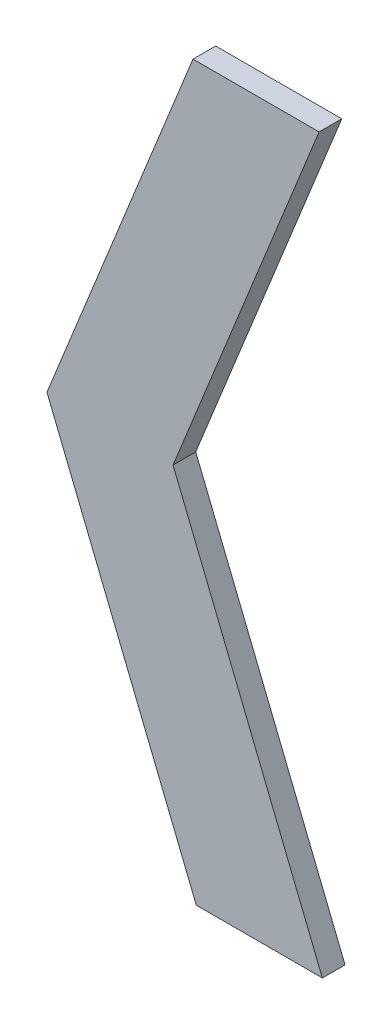
ISO-10303-21;
HEADER;
FILE_DESCRIPTION(('STEP AP214'),'2;1');
FILE_NAME('part.step','',(''),(''),'','','');
FILE_SCHEMA(('AUTOMOTIVE_DESIGN { 1 0 10303 214 1 1 1 1 }'));
ENDSEC;
DATA;
#1=APPLICATION_CONTEXT('core data for automotive mechanical design processes');
#2=APPLICATION_PROTOCOL_DEFINITION('international standard','automotive_design',2000,#1);
#3=PRODUCT_CONTEXT('',#1,'mechanical');
#4=PRODUCT('Part','Part','',(#3));
#5=PRODUCT_RELATED_PRODUCT_CATEGORY('part','',(#4));
#6=PRODUCT_DEFINITION_FORMATION('','',#4);
#7=PRODUCT_DEFINITION_CONTEXT('part definition',#1,'design');
#8=PRODUCT_DEFINITION('design','',#6,#7);
#9=PRODUCT_DEFINITION_SHAPE('','',#8);
#10=(LENGTH_UNIT() NAMED_UNIT(*) SI_UNIT(.MILLI.,.METRE.));
#11=(NAMED_UNIT(*) PLANE_ANGLE_UNIT() SI_UNIT($,.RADIAN.));
#12=(NAMED_UNIT(*) SI_UNIT($,.STERADIAN.) SOLID_ANGLE_UNIT());
#13=UNCERTAINTY_MEASURE_WITH_UNIT(LENGTH_MEASURE(1.E-05),#10,'distance_accuracy_value','');
#14=(GEOMETRIC_REPRESENTATION_CONTEXT(3) GLOBAL_UNCERTAINTY_ASSIGNED_CONTEXT((#13)) GLOBAL_UNIT_ASSIGNED_CONTEXT((#10,
#11,#12)) REPRESENTATION_CONTEXT('',''));
#15=CARTESIAN_POINT('',(0.,0.,0.));
#16=DIRECTION('',(0.,0.,1.));
#17=DIRECTION('',(1.,0.,0.));
#18=AXIS2_PLACEMENT_3D('',#15,#16,#17);
#19=CARTESIAN_POINT('',(0.236672679429646,-0.56437912510646,0.));
#20=DIRECTION('',(0.927183854566676,0.374606593416189,0.));
#21=DIRECTION('',(-0.374606593416189,0.927183854566676,0.));
#22=AXIS2_PLACEMENT_3D('',#19,#20,#21);
#23=PLANE('',#22);
#24=DIRECTION('',(-0.374606593416189,0.927183854566676,0.));
#25=VECTOR('',#24,1.);
#26=CARTESIAN_POINT('',(0.236672679429646,-0.56437912510646,0.));
#27=LINE('',#26,#25);
#28=CARTESIAN_POINT('',(0.236672679429646,-0.56437912510646,0.));
#29=VERTEX_POINT('',#28);
#30=CARTESIAN_POINT('',(0.216922463419016,-0.515495625106459,0.));
#31=VERTEX_POINT('',#30);
#32=EDGE_CURVE('E11',#29,#31,#27,.T.);
#33=ORIENTED_EDGE('',*,*,#32,.T.);
#34=DIRECTION('',(0.,0.,1.));
#35=VECTOR('',#34,1.);
#36=CARTESIAN_POINT('',(0.216922463419016,-0.515495625106459,0.));
#37=LINE('',#36,#35);
#38=CARTESIAN_POINT('',(0.216922463419016,-0.515495625106459,0.003));
#39=VERTEX_POINT('',#38);
#40=EDGE_CURVE('E24',#31,#39,#37,.T.);
#41=ORIENTED_EDGE('',*,*,#40,.T.);
#42=DIRECTION('',(-0.374606593416189,0.927183854566676,0.));
#43=VECTOR('',#42,1.);
#44=CARTESIAN_POINT('',(0.236672679429646,-0.56437912510646,0.003));
#45=LINE('',#44,#43);
#46=CARTESIAN_POINT('',(0.236672679429646,-0.56437912510646,0.003));
#47=VERTEX_POINT('',#46);
#48=EDGE_CURVE('E88',#47,#39,#45,.T.);
#49=ORIENTED_EDGE('',*,*,#48,.F.);
#50=DIRECTION('',(0.,0.,1.));
#51=VECTOR('',#50,1.);
#52=CARTESIAN_POINT('',(0.236672679429646,-0.56437912510646,0.));
#53=LINE('',#52,#51);
#54=EDGE_CURVE('E116',#29,#47,#53,.T.);
#55=ORIENTED_EDGE('',*,*,#54,.F.);
#56=EDGE_LOOP('',(#33,#41,#49,#55));
#57=FACE_BOUND('',#56,.T.);
#58=ADVANCED_FACE('F17',(#57),#23,.T.);
#59=CARTESIAN_POINT('',(0.219995679429646,-0.56437912510646,0.));
#60=DIRECTION('',(0.,-1.,0.));
#61=DIRECTION('',(1.,0.,0.));
#62=AXIS2_PLACEMENT_3D('',#59,#60,#61);
#63=PLANE('',#62);
#64=DIRECTION('',(1.,0.,0.));
#65=VECTOR('',#64,1.);
#66=CARTESIAN_POINT('',(0.219995679429646,-0.56437912510646,0.));
#67=LINE('',#66,#65);
#68=CARTESIAN_POINT('',(0.219995679429646,-0.56437912510646,0.));
#69=VERTEX_POINT('',#68);
#70=EDGE_CURVE('E113',#69,#29,#67,.T.);
#71=ORIENTED_EDGE('',*,*,#70,.T.);
#72=ORIENTED_EDGE('',*,*,#54,.T.);
#73=DIRECTION('',(1.,0.,0.));
#74=VECTOR('',#73,1.);
#75=CARTESIAN_POINT('',(0.219995679429646,-0.56437912510646,0.003));
#76=LINE('',#75,#74);
#77=CARTESIAN_POINT('',(0.219995679429646,-0.56437912510646,0.003));
#78=VERTEX_POINT('',#77);
#79=EDGE_CURVE('E111',#78,#47,#76,.T.);
#80=ORIENTED_EDGE('',*,*,#79,.F.);
#81=DIRECTION('',(0.,0.,1.));
#82=VECTOR('',#81,1.);
#83=CARTESIAN_POINT('',(0.219995679429646,-0.56437912510646,0.));
#84=LINE('',#83,#82);
#85=EDGE_CURVE('E108',#69,#78,#84,.T.);
#86=ORIENTED_EDGE('',*,*,#85,.F.);
#87=EDGE_LOOP('',(#71,#72,#80,#86));
#88=FACE_BOUND('',#87,.T.);
#89=ADVANCED_FACE('F127',(#88),#63,.T.);
#90=CARTESIAN_POINT('',(0.200245463419016,-0.515495625106459,0.));
#91=DIRECTION('',(-0.927183854566676,-0.374606593416189,0.));
#92=DIRECTION('',(0.374606593416189,-0.927183854566676,0.));
#93=AXIS2_PLACEMENT_3D('',#90,#91,#92);
#94=PLANE('',#93);
#95=DIRECTION('',(0.374606593416189,-0.927183854566676,0.));
#96=VECTOR('',#95,1.);
#97=CARTESIAN_POINT('',(0.200245463419016,-0.515495625106459,0.));
#98=LINE('',#97,#96);
#99=CARTESIAN_POINT('',(0.200245463419016,-0.515495625106459,0.));
#100=VERTEX_POINT('',#99);
#101=EDGE_CURVE('E105',#100,#69,#98,.T.);
#102=ORIENTED_EDGE('',*,*,#101,.T.);
#103=ORIENTED_EDGE('',*,*,#85,.T.);
#104=DIRECTION('',(0.374606593416189,-0.927183854566676,0.));
#105=VECTOR('',#104,1.);
#106=CARTESIAN_POINT('',(0.200245463419016,-0.515495625106459,0.003));
#107=LINE('',#106,#105);
#108=CARTESIAN_POINT('',(0.200245463419016,-0.515495625106459,0.003));
#109=VERTEX_POINT('',#108);
#110=EDGE_CURVE('E102',#109,#78,#107,.T.);
#111=ORIENTED_EDGE('',*,*,#110,.F.);
#112=DIRECTION('',(0.,0.,1.));
#113=VECTOR('',#112,1.);
#114=CARTESIAN_POINT('',(0.200245463419016,-0.515495625106459,0.));
#115=LINE('',#114,#113);
#116=EDGE_CURVE('E99',#100,#109,#115,.T.);
#117=ORIENTED_EDGE('',*,*,#116,.F.);
#118=EDGE_LOOP('',(#102,#103,#111,#117));
#119=FACE_BOUND('',#118,.T.);
#120=ADVANCED_FACE('F124',(#119),#94,.T.);
#121=CARTESIAN_POINT('',(0.219562967341736,-0.467683125106459,0.));
#122=DIRECTION('',(-0.927183854566945,0.374606593415521,0.));
#123=DIRECTION('',(-0.374606593415521,-0.927183854566945,0.));
#124=AXIS2_PLACEMENT_3D('',#121,#122,#123);
#125=PLANE('',#124);
#126=DIRECTION('',(-0.374606593415521,-0.927183854566945,0.));
#127=VECTOR('',#126,1.);
#128=CARTESIAN_POINT('',(0.219562967341736,-0.467683125106459,0.));
#129=LINE('',#128,#127);
#130=CARTESIAN_POINT('',(0.219562967341736,-0.467683125106459,0.));
#131=VERTEX_POINT('',#130);
#132=EDGE_CURVE('E96',#131,#100,#129,.T.);
#133=ORIENTED_EDGE('',*,*,#132,.T.);
#134=ORIENTED_EDGE('',*,*,#116,.T.);
#135=DIRECTION('',(-0.374606593415521,-0.927183854566945,0.));
#136=VECTOR('',#135,1.);
#137=CARTESIAN_POINT('',(0.219562967341736,-0.467683125106459,0.003));
#138=LINE('',#137,#136);
#139=CARTESIAN_POINT('',(0.219562967341736,-0.467683125106459,0.003));
#140=VERTEX_POINT('',#139);
#141=EDGE_CURVE('E94',#140,#109,#138,.T.);
#142=ORIENTED_EDGE('',*,*,#141,.F.);
#143=DIRECTION('',(0.,0.,1.));
#144=VECTOR('',#143,1.);
#145=CARTESIAN_POINT('',(0.219562967341736,-0.467683125106459,0.));
#146=LINE('',#145,#144);
#147=EDGE_CURVE('E73',#131,#140,#146,.T.);
#148=ORIENTED_EDGE('',*,*,#147,.F.);
#149=EDGE_LOOP('',(#133,#134,#142,#148));
#150=FACE_BOUND('',#149,.T.);
#151=ADVANCED_FACE('F122',(#150),#125,.T.);
#152=CARTESIAN_POINT('',(0.236239967341736,-0.467683125106459,0.));
#153=DIRECTION('',(0.,1.,0.));
#154=DIRECTION('',(-1.,0.,0.));
#155=AXIS2_PLACEMENT_3D('',#152,#153,#154);
#156=PLANE('',#155);
#157=DIRECTION('',(-1.,0.,0.));
#158=VECTOR('',#157,1.);
#159=CARTESIAN_POINT('',(0.236239967341736,-0.467683125106459,0.));
#160=LINE('',#159,#158);
#161=CARTESIAN_POINT('',(0.236239967341736,-0.467683125106459,0.));
#162=VERTEX_POINT('',#161);
#163=EDGE_CURVE('E77',#162,#131,#160,.T.);
#164=ORIENTED_EDGE('',*,*,#163,.T.);
#165=ORIENTED_EDGE('',*,*,#147,.T.);
#166=DIRECTION('',(-1.,0.,0.));
#167=VECTOR('',#166,1.);
#168=CARTESIAN_POINT('',(0.236239967341736,-0.467683125106459,0.003));
#169=LINE('',#168,#167);
#170=CARTESIAN_POINT('',(0.236239967341736,-0.467683125106459,0.003));
#171=VERTEX_POINT('',#170);
#172=EDGE_CURVE('E66',#171,#140,#169,.T.);
#173=ORIENTED_EDGE('',*,*,#172,.F.);
#174=DIRECTION('',(0.,0.,1.));
#175=VECTOR('',#174,1.);
#176=CARTESIAN_POINT('',(0.236239967341736,-0.467683125106459,0.));
#177=LINE('',#176,#175);
#178=EDGE_CURVE('E70',#162,#171,#177,.T.);
#179=ORIENTED_EDGE('',*,*,#178,.F.);
#180=EDGE_LOOP('',(#164,#165,#173,#179));
#181=FACE_BOUND('',#180,.T.);
#182=ADVANCED_FACE('F69',(#181),#156,.T.);
#183=CARTESIAN_POINT('',(0.216922463419016,-0.515495625106459,0.));
#184=DIRECTION('',(0.927183854566945,-0.374606593415522,0.));
#185=DIRECTION('',(0.374606593415522,0.927183854566945,0.));
#186=AXIS2_PLACEMENT_3D('',#183,#184,#185);
#187=PLANE('',#186);
#188=DIRECTION('',(0.374606593415522,0.927183854566945,0.));
#189=VECTOR('',#188,1.);
#190=CARTESIAN_POINT('',(0.216922463419016,-0.515495625106459,0.));
#191=LINE('',#190,#189);
#192=EDGE_CURVE('E83',#31,#162,#191,.T.);
#193=ORIENTED_EDGE('',*,*,#192,.T.);
#194=ORIENTED_EDGE('',*,*,#178,.T.);
#195=DIRECTION('',(0.374606593415522,0.927183854566945,0.));
#196=VECTOR('',#195,1.);
#197=CARTESIAN_POINT('',(0.216922463419016,-0.515495625106459,0.003));
#198=LINE('',#197,#196);
#199=EDGE_CURVE('E82',#39,#171,#198,.T.);
#200=ORIENTED_EDGE('',*,*,#199,.F.);
#201=ORIENTED_EDGE('',*,*,#40,.F.);
#202=EDGE_LOOP('',(#193,#194,#200,#201));
#203=FACE_BOUND('',#202,.T.);
#204=ADVANCED_FACE('F81',(#203),#187,.T.);
#205=CARTESIAN_POINT('',(0.218459071424331,-0.51603112510646,0.003));
#206=DIRECTION('',(0.,0.,1.));
#207=DIRECTION('',(1.,0.,0.));
#208=AXIS2_PLACEMENT_3D('',#205,#206,#207);
#209=PLANE('',#208);
#210=ORIENTED_EDGE('',*,*,#199,.T.);
#211=ORIENTED_EDGE('',*,*,#172,.T.);
#212=ORIENTED_EDGE('',*,*,#141,.T.);
#213=ORIENTED_EDGE('',*,*,#110,.T.);
#214=ORIENTED_EDGE('',*,*,#79,.T.);
#215=ORIENTED_EDGE('',*,*,#48,.T.);
#216=EDGE_LOOP('',(#210,#211,#212,#213,#214,#215));
#217=FACE_BOUND('',#216,.T.);
#218=ADVANCED_FACE('F86',(#217),#209,.T.);
#219=CARTESIAN_POINT('',(0.218459071424331,-0.51603112510646,0.));
#220=DIRECTION('',(0.,0.,1.));
#221=DIRECTION('',(1.,0.,0.));
#222=AXIS2_PLACEMENT_3D('',#219,#220,#221);
#223=PLANE('',#222);
#224=ORIENTED_EDGE('',*,*,#192,.F.);
#225=ORIENTED_EDGE('',*,*,#32,.F.);
#226=ORIENTED_EDGE('',*,*,#70,.F.);
#227=ORIENTED_EDGE('',*,*,#101,.F.);
#228=ORIENTED_EDGE('',*,*,#132,.F.);
#229=ORIENTED_EDGE('',*,*,#163,.F.);
#230=EDGE_LOOP('',(#224,#225,#226,#227,#228,#229));
#231=FACE_BOUND('',#230,.T.);
#232=ADVANCED_FACE('F119',(#231),#223,.F.);
#233=CLOSED_SHELL('',(#58,#89,#120,#151,#182,#204,#218,#232));
#234=MANIFOLD_SOLID_BREP('B1',#233);
#235=ADVANCED_BREP_SHAPE_REPRESENTATION('',(#18,#234),#14);
#236=SHAPE_DEFINITION_REPRESENTATION(#9,#235);
ENDSEC;
END-ISO-10303-21;
